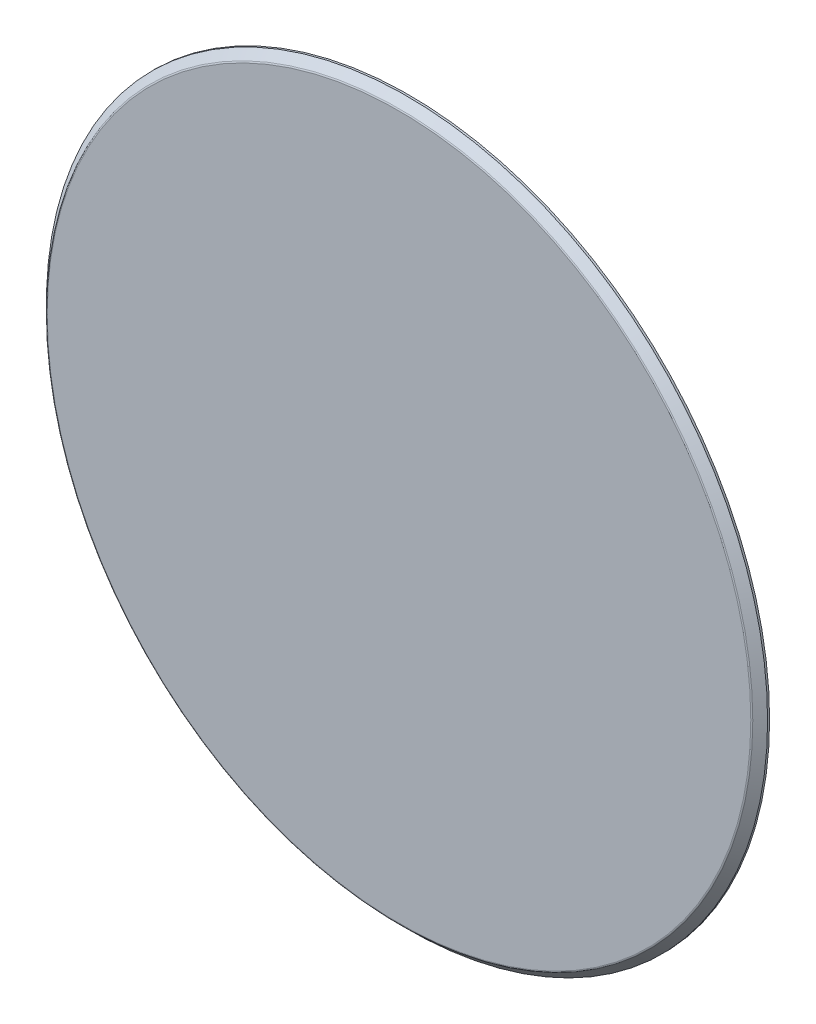
ISO-10303-21;
HEADER;
FILE_DESCRIPTION(('STEP AP214'),'2;1');
FILE_NAME('part.step','',(''),(''),'','','');
FILE_SCHEMA(('AUTOMOTIVE_DESIGN { 1 0 10303 214 1 1 1 1 }'));
ENDSEC;
DATA;
#1=APPLICATION_CONTEXT('core data for automotive mechanical design processes');
#2=APPLICATION_PROTOCOL_DEFINITION('international standard','automotive_design',2000,#1);
#3=PRODUCT_CONTEXT('',#1,'mechanical');
#4=PRODUCT('Part','Part','',(#3));
#5=PRODUCT_RELATED_PRODUCT_CATEGORY('part','',(#4));
#6=PRODUCT_DEFINITION_FORMATION('','',#4);
#7=PRODUCT_DEFINITION_CONTEXT('part definition',#1,'design');
#8=PRODUCT_DEFINITION('design','',#6,#7);
#9=PRODUCT_DEFINITION_SHAPE('','',#8);
#10=(LENGTH_UNIT() NAMED_UNIT(*) SI_UNIT(.MILLI.,.METRE.));
#11=(NAMED_UNIT(*) PLANE_ANGLE_UNIT() SI_UNIT($,.RADIAN.));
#12=(NAMED_UNIT(*) SI_UNIT($,.STERADIAN.) SOLID_ANGLE_UNIT());
#13=UNCERTAINTY_MEASURE_WITH_UNIT(LENGTH_MEASURE(1.E-05),#10,'distance_accuracy_value','');
#14=(GEOMETRIC_REPRESENTATION_CONTEXT(3) GLOBAL_UNCERTAINTY_ASSIGNED_CONTEXT((#13)) GLOBAL_UNIT_ASSIGNED_CONTEXT((#10,
#11,#12)) REPRESENTATION_CONTEXT('',''));
#15=CARTESIAN_POINT('',(0.,0.,0.));
#16=DIRECTION('',(0.,0.,1.));
#17=DIRECTION('',(1.,0.,0.));
#18=AXIS2_PLACEMENT_3D('',#15,#16,#17);
#19=CARTESIAN_POINT('',(0.,20.,0.5));
#20=DIRECTION('',(0.,0.,-1.));
#21=DIRECTION('',(-1.,0.,0.));
#22=AXIS2_PLACEMENT_3D('',#19,#20,#21);
#23=CYLINDRICAL_SURFACE('',#22,18.047503829528);
#24=CARTESIAN_POINT('',(0.,20.,0.0999999999999921));
#25=DIRECTION('',(0.,0.,1.));
#26=DIRECTION('',(1.,0.,0.));
#27=AXIS2_PLACEMENT_3D('',#24,#25,#26);
#28=CIRCLE('',#27,18.047503829528);
#29=CARTESIAN_POINT('',(18.047503829528,20.,0.0999999999999921));
#30=VERTEX_POINT('',#29);
#31=EDGE_CURVE('E42',#30,#30,#28,.F.);
#32=ORIENTED_EDGE('',*,*,#31,.T.);
#33=EDGE_LOOP('',(#32));
#34=FACE_BOUND('',#33,.T.);
#35=CARTESIAN_POINT('',(0.,20.,0.));
#36=DIRECTION('',(0.,0.,1.));
#37=DIRECTION('',(1.,0.,0.));
#38=AXIS2_PLACEMENT_3D('',#35,#36,#37);
#39=CIRCLE('',#38,18.047503829528);
#40=CARTESIAN_POINT('',(18.047503829528,20.,0.));
#41=VERTEX_POINT('',#40);
#42=EDGE_CURVE('E46',#41,#41,#39,.T.);
#43=ORIENTED_EDGE('',*,*,#42,.T.);
#44=EDGE_LOOP('',(#43));
#45=FACE_BOUND('',#44,.T.);
#46=ADVANCED_FACE('F31',(#34,#45),#23,.T.);
#47=CARTESIAN_POINT('',(0.,20.,0.5));
#48=DIRECTION('',(0.,0.,1.));
#49=DIRECTION('',(1.,0.,0.));
#50=AXIS2_PLACEMENT_3D('',#47,#48,#49);
#51=PLANE('',#50);
#52=CARTESIAN_POINT('',(0.,20.,0.5));
#53=DIRECTION('',(0.,0.,1.));
#54=DIRECTION('',(1.,0.,0.));
#55=AXIS2_PLACEMENT_3D('',#52,#53,#54);
#56=CIRCLE('',#55,17.6060824732907);
#57=CARTESIAN_POINT('',(17.6060824732907,20.,0.5));
#58=VERTEX_POINT('',#57);
#59=EDGE_CURVE('E38',#58,#58,#56,.T.);
#60=ORIENTED_EDGE('',*,*,#59,.T.);
#61=EDGE_LOOP('',(#60));
#62=FACE_BOUND('',#61,.T.);
#63=ADVANCED_FACE('F56',(#62),#51,.T.);
#64=CARTESIAN_POINT('',(0.,20.,0.));
#65=DIRECTION('',(0.,0.,1.));
#66=DIRECTION('',(1.,0.,0.));
#67=AXIS2_PLACEMENT_3D('',#64,#65,#66);
#68=PLANE('',#67);
#69=ORIENTED_EDGE('',*,*,#42,.F.);
#70=EDGE_LOOP('',(#69));
#71=FACE_BOUND('',#70,.T.);
#72=ADVANCED_FACE('F53',(#71),#68,.F.);
#73=CARTESIAN_POINT('',(0.,20.,0.5));
#74=DIRECTION('',(0.,0.,-1.));
#75=DIRECTION('',(-1.,0.,0.));
#76=AXIS2_PLACEMENT_3D('',#73,#74,#75);
#77=CONICAL_SURFACE('',#76,17.647503829528,0.785398163397448);
#78=CARTESIAN_POINT('',(0.,20.,0.470710678118658));
#79=DIRECTION('',(0.,0.,1.));
#80=DIRECTION('',(1.,0.,0.));
#81=AXIS2_PLACEMENT_3D('',#78,#79,#80);
#82=CIRCLE('',#81,17.6767931514093);
#83=CARTESIAN_POINT('',(17.6767931514093,20.,0.470710678118658));
#84=VERTEX_POINT('',#83);
#85=EDGE_CURVE('E10',#84,#84,#82,.F.);
#86=ORIENTED_EDGE('',*,*,#85,.T.);
#87=EDGE_LOOP('',(#86));
#88=FACE_BOUND('',#87,.T.);
#89=ORIENTED_EDGE('',*,*,#31,.F.);
#90=EDGE_LOOP('',(#89));
#91=FACE_BOUND('',#90,.T.);
#92=ADVANCED_FACE('F55',(#88,#91),#77,.T.);
#93=CARTESIAN_POINT('',(0.,20.,0.4));
#94=DIRECTION('',(0.,0.,1.));
#95=DIRECTION('',(1.,0.,0.));
#96=AXIS2_PLACEMENT_3D('',#93,#94,#95);
#97=TOROIDAL_SURFACE('',#96,17.6060824732907,0.1);
#98=ORIENTED_EDGE('',*,*,#85,.F.);
#99=EDGE_LOOP('',(#98));
#100=FACE_BOUND('',#99,.T.);
#101=ORIENTED_EDGE('',*,*,#59,.F.);
#102=EDGE_LOOP('',(#101));
#103=FACE_BOUND('',#102,.T.);
#104=ADVANCED_FACE('F33',(#100,#103),#97,.T.);
#105=CLOSED_SHELL('',(#46,#63,#72,#92,#104));
#106=MANIFOLD_SOLID_BREP('B2',#105);
#107=ADVANCED_BREP_SHAPE_REPRESENTATION('',(#18,#106),#14);
#108=SHAPE_DEFINITION_REPRESENTATION(#9,#107);
ENDSEC;
END-ISO-10303-21;
